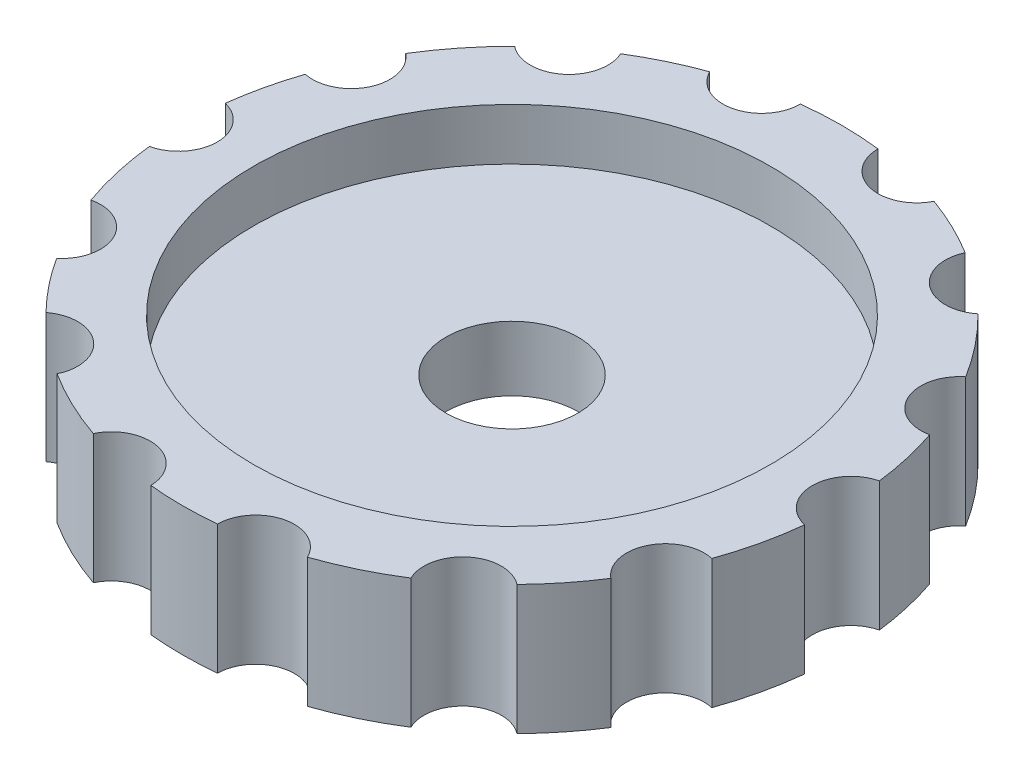
ISO-10303-21;
HEADER;
FILE_DESCRIPTION(('STEP AP214'),'2;1');
FILE_NAME('part.step','',(''),(''),'','','');
FILE_SCHEMA(('AUTOMOTIVE_DESIGN { 1 0 10303 214 1 1 1 1 }'));
ENDSEC;
DATA;
#1=APPLICATION_CONTEXT('core data for automotive mechanical design processes');
#2=APPLICATION_PROTOCOL_DEFINITION('international standard','automotive_design',2000,#1);
#3=PRODUCT_CONTEXT('',#1,'mechanical');
#4=PRODUCT('Part','Part','',(#3));
#5=PRODUCT_RELATED_PRODUCT_CATEGORY('part','',(#4));
#6=PRODUCT_DEFINITION_FORMATION('','',#4);
#7=PRODUCT_DEFINITION_CONTEXT('part definition',#1,'design');
#8=PRODUCT_DEFINITION('design','',#6,#7);
#9=PRODUCT_DEFINITION_SHAPE('','',#8);
#10=(LENGTH_UNIT() NAMED_UNIT(*) SI_UNIT(.MILLI.,.METRE.));
#11=(NAMED_UNIT(*) PLANE_ANGLE_UNIT() SI_UNIT($,.RADIAN.));
#12=(NAMED_UNIT(*) SI_UNIT($,.STERADIAN.) SOLID_ANGLE_UNIT());
#13=UNCERTAINTY_MEASURE_WITH_UNIT(LENGTH_MEASURE(1.E-05),#10,'distance_accuracy_value','');
#14=(GEOMETRIC_REPRESENTATION_CONTEXT(3) GLOBAL_UNCERTAINTY_ASSIGNED_CONTEXT((#13)) GLOBAL_UNIT_ASSIGNED_CONTEXT((#10,
#11,#12)) REPRESENTATION_CONTEXT('',''));
#15=CARTESIAN_POINT('',(0.,0.,0.));
#16=DIRECTION('',(0.,0.,1.));
#17=DIRECTION('',(1.,0.,0.));
#18=AXIS2_PLACEMENT_3D('',#15,#16,#17);
#19=CARTESIAN_POINT('',(0.,2.5,0.));
#20=DIRECTION('',(0.,-1.,0.));
#21=DIRECTION('',(0.,0.,-1.));
#22=AXIS2_PLACEMENT_3D('',#19,#20,#21);
#23=CYLINDRICAL_SURFACE('',#22,12.75);
#24=CARTESIAN_POINT('',(0.,-2.5,0.));
#25=DIRECTION('',(0.,1.,0.));
#26=DIRECTION('',(0.,0.,1.));
#27=AXIS2_PLACEMENT_3D('',#24,#25,#26);
#28=CIRCLE('',#27,12.75);
#29=CARTESIAN_POINT('',(12.653707331973,-2.5,-1.5640302927926));
#30=VERTEX_POINT('',#29);
#31=CARTESIAN_POINT('',(12.0792036811861,-2.5,-4.08109524863352));
#32=VERTEX_POINT('',#31);
#33=EDGE_CURVE('E214',#30,#32,#28,.T.);
#34=ORIENTED_EDGE('',*,*,#33,.T.);
#35=DIRECTION('',(0.,1.,0.));
#36=VECTOR('',#35,1.);
#37=CARTESIAN_POINT('',(12.0792036811861,0.,-4.08109524863353));
#38=LINE('',#37,#36);
#39=CARTESIAN_POINT('',(12.0792036811861,2.5,-4.08109524863352));
#40=VERTEX_POINT('',#39);
#41=EDGE_CURVE('E32',#32,#40,#38,.T.);
#42=ORIENTED_EDGE('',*,*,#41,.T.);
#43=CARTESIAN_POINT('',(0.,2.5,0.));
#44=DIRECTION('',(0.,1.,0.));
#45=DIRECTION('',(0.,0.,1.));
#46=AXIS2_PLACEMENT_3D('',#43,#44,#45);
#47=CIRCLE('',#46,12.75);
#48=CARTESIAN_POINT('',(12.653707331973,2.5,-1.5640302927926));
#49=VERTEX_POINT('',#48);
#50=EDGE_CURVE('E335',#49,#40,#47,.T.);
#51=ORIENTED_EDGE('',*,*,#50,.F.);
#52=DIRECTION('',(0.,1.,0.));
#53=VECTOR('',#52,1.);
#54=CARTESIAN_POINT('',(12.653707331973,0.,-1.5640302927926));
#55=LINE('',#54,#53);
#56=EDGE_CURVE('E293',#49,#30,#55,.F.);
#57=ORIENTED_EDGE('',*,*,#56,.T.);
#58=EDGE_LOOP('',(#34,#42,#51,#57));
#59=FACE_BOUND('',#58,.T.);
#60=ADVANCED_FACE('F17',(#59),#23,.T.);
#61=CARTESIAN_POINT('',(10.8343606042217,2.5,-6.72154225588801));
#62=VERTEX_POINT('',#61);
#63=CARTESIAN_POINT('',(8.9638911986455,2.5,-9.06703670329208));
#64=VERTEX_POINT('',#63);
#65=EDGE_CURVE('E208',#62,#64,#47,.T.);
#66=ORIENTED_EDGE('',*,*,#65,.F.);
#67=DIRECTION('',(0.,1.,0.));
#68=VECTOR('',#67,1.);
#69=CARTESIAN_POINT('',(10.8343606042217,0.,-6.72154225588801));
#70=LINE('',#69,#68);
#71=CARTESIAN_POINT('',(10.8343606042217,-2.5,-6.72154225588801));
#72=VERTEX_POINT('',#71);
#73=EDGE_CURVE('E201',#62,#72,#70,.F.);
#74=ORIENTED_EDGE('',*,*,#73,.T.);
#75=CARTESIAN_POINT('',(8.9638911986455,-2.5,-9.06703670329208));
#76=VERTEX_POINT('',#75);
#77=EDGE_CURVE('E39',#72,#76,#28,.T.);
#78=ORIENTED_EDGE('',*,*,#77,.T.);
#79=DIRECTION('',(0.,1.,0.));
#80=VECTOR('',#79,1.);
#81=CARTESIAN_POINT('',(8.9638911986455,0.,-9.06703670329208));
#82=LINE('',#81,#80);
#83=EDGE_CURVE('E508',#76,#64,#82,.T.);
#84=ORIENTED_EDGE('',*,*,#83,.T.);
#85=EDGE_LOOP('',(#66,#74,#78,#84));
#86=FACE_BOUND('',#85,.T.);
#87=ADVANCED_FACE('F207',(#86),#23,.T.);
#88=CARTESIAN_POINT('',(9.11226559962918,-2.5,8.91790982471872));
#89=VERTEX_POINT('',#88);
#90=CARTESIAN_POINT('',(10.7219890581264,-2.5,6.89938045315794));
#91=VERTEX_POINT('',#90);
#92=EDGE_CURVE('E263',#89,#91,#28,.T.);
#93=ORIENTED_EDGE('',*,*,#92,.T.);
#94=DIRECTION('',(0.,1.,0.));
#95=VECTOR('',#94,1.);
#96=CARTESIAN_POINT('',(10.7219890581264,0.,6.89938045315794));
#97=LINE('',#96,#95);
#98=CARTESIAN_POINT('',(10.7219890581264,2.5,6.89938045315794));
#99=VERTEX_POINT('',#98);
#100=EDGE_CURVE('E503',#91,#99,#97,.T.);
#101=ORIENTED_EDGE('',*,*,#100,.T.);
#102=CARTESIAN_POINT('',(9.11226559962918,2.5,8.91790982471872));
#103=VERTEX_POINT('',#102);
#104=EDGE_CURVE('E344',#103,#99,#47,.T.);
#105=ORIENTED_EDGE('',*,*,#104,.F.);
#106=DIRECTION('',(0.,1.,0.));
#107=VECTOR('',#106,1.);
#108=CARTESIAN_POINT('',(9.11226559962918,0.,8.91790982471872));
#109=LINE('',#108,#107);
#110=EDGE_CURVE('E491',#103,#89,#109,.F.);
#111=ORIENTED_EDGE('',*,*,#110,.T.);
#112=EDGE_LOOP('',(#93,#101,#105,#111));
#113=FACE_BOUND('',#112,.T.);
#114=ADVANCED_FACE('F439',(#113),#23,.T.);
#115=CARTESIAN_POINT('',(12.0102266927847,2.5,4.2798311634832));
#116=VERTEX_POINT('',#115);
#117=CARTESIAN_POINT('',(12.6777894946536,2.5,1.35504742693773));
#118=VERTEX_POINT('',#117);
#119=EDGE_CURVE('E339',#116,#118,#47,.T.);
#120=ORIENTED_EDGE('',*,*,#119,.F.);
#121=DIRECTION('',(0.,1.,0.));
#122=VECTOR('',#121,1.);
#123=CARTESIAN_POINT('',(12.0102266927847,0.,4.2798311634832));
#124=LINE('',#123,#122);
#125=CARTESIAN_POINT('',(12.0102266927847,-2.5,4.2798311634832));
#126=VERTEX_POINT('',#125);
#127=EDGE_CURVE('E282',#116,#126,#124,.F.);
#128=ORIENTED_EDGE('',*,*,#127,.T.);
#129=CARTESIAN_POINT('',(12.6777894946536,-2.5,1.35504742693773));
#130=VERTEX_POINT('',#129);
#131=EDGE_CURVE('E218',#126,#130,#28,.T.);
#132=ORIENTED_EDGE('',*,*,#131,.T.);
#133=DIRECTION('',(0.,1.,0.));
#134=VECTOR('',#133,1.);
#135=CARTESIAN_POINT('',(12.6777894946536,0.,1.35504742693773));
#136=LINE('',#135,#134);
#137=EDGE_CURVE('E281',#130,#118,#136,.T.);
#138=ORIENTED_EDGE('',*,*,#137,.T.);
#139=EDGE_LOOP('',(#120,#128,#132,#138));
#140=FACE_BOUND('',#139,.T.);
#141=ADVANCED_FACE('F280',(#140),#23,.T.);
#142=CARTESIAN_POINT('',(-1.29089798557912,-2.5,12.6844819520084));
#143=VERTEX_POINT('',#142);
#144=CARTESIAN_POINT('',(1.29089798557929,-2.5,12.6844819520084));
#145=VERTEX_POINT('',#144);
#146=EDGE_CURVE('E250',#143,#145,#28,.T.);
#147=ORIENTED_EDGE('',*,*,#146,.T.);
#148=DIRECTION('',(0.,1.,0.));
#149=VECTOR('',#148,1.);
#150=CARTESIAN_POINT('',(1.2908979855793,0.,12.6844819520084));
#151=LINE('',#150,#149);
#152=CARTESIAN_POINT('',(1.2908979855793,2.5,12.6844819520084));
#153=VERTEX_POINT('',#152);
#154=EDGE_CURVE('E496',#145,#153,#151,.T.);
#155=ORIENTED_EDGE('',*,*,#154,.T.);
#156=CARTESIAN_POINT('',(-1.29089798557912,2.5,12.6844819520084));
#157=VERTEX_POINT('',#156);
#158=EDGE_CURVE('E350',#157,#153,#47,.T.);
#159=ORIENTED_EDGE('',*,*,#158,.F.);
#160=DIRECTION('',(0.,1.,0.));
#161=VECTOR('',#160,1.);
#162=CARTESIAN_POINT('',(-1.29089798557912,0.,12.6844819520084));
#163=LINE('',#162,#161);
#164=EDGE_CURVE('E482',#157,#143,#163,.F.);
#165=ORIENTED_EDGE('',*,*,#164,.T.);
#166=EDGE_LOOP('',(#147,#155,#159,#165));
#167=FACE_BOUND('',#166,.T.);
#168=ADVANCED_FACE('F762',(#167),#23,.T.);
#169=CARTESIAN_POINT('',(4.14214711770383,2.5,12.0584044241059));
#170=VERTEX_POINT('',#169);
#171=CARTESIAN_POINT('',(6.84505372141108,2.5,10.7567532067532));
#172=VERTEX_POINT('',#171);
#173=EDGE_CURVE('E340',#170,#172,#47,.T.);
#174=ORIENTED_EDGE('',*,*,#173,.F.);
#175=DIRECTION('',(0.,1.,0.));
#176=VECTOR('',#175,1.);
#177=CARTESIAN_POINT('',(4.14214711770383,0.,12.0584044241059));
#178=LINE('',#177,#176);
#179=CARTESIAN_POINT('',(4.14214711770383,-2.5,12.0584044241059));
#180=VERTEX_POINT('',#179);
#181=EDGE_CURVE('E498',#170,#180,#178,.F.);
#182=ORIENTED_EDGE('',*,*,#181,.T.);
#183=CARTESIAN_POINT('',(6.84505372141108,-2.5,10.7567532067532));
#184=VERTEX_POINT('',#183);
#185=EDGE_CURVE('E219',#180,#184,#28,.T.);
#186=ORIENTED_EDGE('',*,*,#185,.T.);
#187=DIRECTION('',(0.,1.,0.));
#188=VECTOR('',#187,1.);
#189=CARTESIAN_POINT('',(6.84505372141108,0.,10.7567532067532));
#190=LINE('',#189,#188);
#191=EDGE_CURVE('E473',#184,#172,#190,.T.);
#192=ORIENTED_EDGE('',*,*,#191,.T.);
#193=EDGE_LOOP('',(#174,#182,#186,#192));
#194=FACE_BOUND('',#193,.T.);
#195=ADVANCED_FACE('F754',(#194),#23,.T.);
#196=CARTESIAN_POINT('',(-10.7219890581263,-2.5,6.89938045315808));
#197=VERTEX_POINT('',#196);
#198=CARTESIAN_POINT('',(-9.11226559962905,-2.5,8.91790982471885));
#199=VERTEX_POINT('',#198);
#200=EDGE_CURVE('E234',#197,#199,#28,.T.);
#201=ORIENTED_EDGE('',*,*,#200,.T.);
#202=DIRECTION('',(0.,1.,0.));
#203=VECTOR('',#202,1.);
#204=CARTESIAN_POINT('',(-9.11226559962905,0.,8.91790982471885));
#205=LINE('',#204,#203);
#206=CARTESIAN_POINT('',(-9.11226559962905,2.5,8.91790982471885));
#207=VERTEX_POINT('',#206);
#208=EDGE_CURVE('E469',#199,#207,#205,.T.);
#209=ORIENTED_EDGE('',*,*,#208,.T.);
#210=CARTESIAN_POINT('',(-10.7219890581263,2.5,6.89938045315808));
#211=VERTEX_POINT('',#210);
#212=EDGE_CURVE('E333',#211,#207,#47,.T.);
#213=ORIENTED_EDGE('',*,*,#212,.F.);
#214=DIRECTION('',(0.,1.,0.));
#215=VECTOR('',#214,1.);
#216=CARTESIAN_POINT('',(-10.7219890581263,0.,6.89938045315808));
#217=LINE('',#216,#215);
#218=EDGE_CURVE('E379',#211,#197,#217,.F.);
#219=ORIENTED_EDGE('',*,*,#218,.T.);
#220=EDGE_LOOP('',(#201,#209,#213,#219));
#221=FACE_BOUND('',#220,.T.);
#222=ADVANCED_FACE('F467',(#221),#23,.T.);
#223=CARTESIAN_POINT('',(-6.84505372141093,2.5,10.7567532067533));
#224=VERTEX_POINT('',#223);
#225=CARTESIAN_POINT('',(-4.14214711770367,2.5,12.058404424106));
#226=VERTEX_POINT('',#225);
#227=EDGE_CURVE('E347',#224,#226,#47,.T.);
#228=ORIENTED_EDGE('',*,*,#227,.F.);
#229=DIRECTION('',(0.,1.,0.));
#230=VECTOR('',#229,1.);
#231=CARTESIAN_POINT('',(-6.84505372141093,0.,10.7567532067533));
#232=LINE('',#231,#230);
#233=CARTESIAN_POINT('',(-6.84505372141093,-2.5,10.7567532067533));
#234=VERTEX_POINT('',#233);
#235=EDGE_CURVE('E472',#224,#234,#232,.F.);
#236=ORIENTED_EDGE('',*,*,#235,.T.);
#237=CARTESIAN_POINT('',(-4.14214711770367,-2.5,12.058404424106));
#238=VERTEX_POINT('',#237);
#239=EDGE_CURVE('E257',#234,#238,#28,.T.);
#240=ORIENTED_EDGE('',*,*,#239,.T.);
#241=DIRECTION('',(0.,1.,0.));
#242=VECTOR('',#241,1.);
#243=CARTESIAN_POINT('',(-4.14214711770367,0.,12.058404424106));
#244=LINE('',#243,#242);
#245=EDGE_CURVE('E480',#238,#226,#244,.T.);
#246=ORIENTED_EDGE('',*,*,#245,.T.);
#247=EDGE_LOOP('',(#228,#236,#240,#246));
#248=FACE_BOUND('',#247,.T.);
#249=ADVANCED_FACE('F478',(#248),#23,.T.);
#250=CARTESIAN_POINT('',(-12.0792036811862,-2.5,-4.08109524863336));
#251=VERTEX_POINT('',#250);
#252=CARTESIAN_POINT('',(-12.653707331973,-2.5,-1.56403029279243));
#253=VERTEX_POINT('',#252);
#254=EDGE_CURVE('E233',#251,#253,#28,.T.);
#255=ORIENTED_EDGE('',*,*,#254,.T.);
#256=DIRECTION('',(0.,1.,0.));
#257=VECTOR('',#256,1.);
#258=CARTESIAN_POINT('',(-12.653707331973,0.,-1.56403029279243));
#259=LINE('',#258,#257);
#260=CARTESIAN_POINT('',(-12.653707331973,2.5,-1.56403029279243));
#261=VERTEX_POINT('',#260);
#262=EDGE_CURVE('E374',#253,#261,#259,.T.);
#263=ORIENTED_EDGE('',*,*,#262,.T.);
#264=CARTESIAN_POINT('',(-12.0792036811862,2.5,-4.08109524863336));
#265=VERTEX_POINT('',#264);
#266=EDGE_CURVE('E232',#265,#261,#47,.T.);
#267=ORIENTED_EDGE('',*,*,#266,.F.);
#268=DIRECTION('',(0.,1.,0.));
#269=VECTOR('',#268,1.);
#270=CARTESIAN_POINT('',(-12.0792036811862,0.,-4.08109524863336));
#271=LINE('',#270,#269);
#272=EDGE_CURVE('E373',#265,#251,#271,.F.);
#273=ORIENTED_EDGE('',*,*,#272,.T.);
#274=EDGE_LOOP('',(#255,#263,#267,#273));
#275=FACE_BOUND('',#274,.T.);
#276=ADVANCED_FACE('F372',(#275),#23,.T.);
#277=CARTESIAN_POINT('',(-12.6777894946536,2.5,1.3550474269379));
#278=VERTEX_POINT('',#277);
#279=CARTESIAN_POINT('',(-12.0102266927846,2.5,4.27983116348336));
#280=VERTEX_POINT('',#279);
#281=EDGE_CURVE('E356',#278,#280,#47,.T.);
#282=ORIENTED_EDGE('',*,*,#281,.F.);
#283=DIRECTION('',(0.,1.,0.));
#284=VECTOR('',#283,1.);
#285=CARTESIAN_POINT('',(-12.6777894946536,0.,1.3550474269379));
#286=LINE('',#285,#284);
#287=CARTESIAN_POINT('',(-12.6777894946536,-2.5,1.3550474269379));
#288=VERTEX_POINT('',#287);
#289=EDGE_CURVE('E377',#278,#288,#286,.F.);
#290=ORIENTED_EDGE('',*,*,#289,.T.);
#291=CARTESIAN_POINT('',(-12.0102266927846,-2.5,4.27983116348336));
#292=VERTEX_POINT('',#291);
#293=EDGE_CURVE('E245',#288,#292,#28,.T.);
#294=ORIENTED_EDGE('',*,*,#293,.T.);
#295=DIRECTION('',(0.,1.,0.));
#296=VECTOR('',#295,1.);
#297=CARTESIAN_POINT('',(-12.0102266927846,0.,4.27983116348336));
#298=LINE('',#297,#296);
#299=EDGE_CURVE('E386',#292,#280,#298,.T.);
#300=ORIENTED_EDGE('',*,*,#299,.T.);
#301=EDGE_LOOP('',(#282,#290,#294,#300));
#302=FACE_BOUND('',#301,.T.);
#303=ADVANCED_FACE('F460',(#302),#23,.T.);
#304=CARTESIAN_POINT('',(-4.3405315614618,-2.5,-11.9884229890321));
#305=VERTEX_POINT('',#304);
#306=CARTESIAN_POINT('',(-6.66664935475142,-2.5,-10.8682236994273));
#307=VERTEX_POINT('',#306);
#308=EDGE_CURVE('E217',#305,#307,#28,.T.);
#309=ORIENTED_EDGE('',*,*,#308,.T.);
#310=DIRECTION('',(0.,1.,0.));
#311=VECTOR('',#310,1.);
#312=CARTESIAN_POINT('',(-6.66664935475143,0.,-10.8682236994273));
#313=LINE('',#312,#311);
#314=CARTESIAN_POINT('',(-6.66664935475143,2.5,-10.8682236994273));
#315=VERTEX_POINT('',#314);
#316=EDGE_CURVE('E393',#307,#315,#313,.T.);
#317=ORIENTED_EDGE('',*,*,#316,.T.);
#318=CARTESIAN_POINT('',(-4.3405315614618,2.5,-11.9884229890321));
#319=VERTEX_POINT('',#318);
#320=EDGE_CURVE('E231',#319,#315,#47,.T.);
#321=ORIENTED_EDGE('',*,*,#320,.F.);
#322=DIRECTION('',(0.,1.,0.));
#323=VECTOR('',#322,1.);
#324=CARTESIAN_POINT('',(-4.3405315614618,0.,-11.9884229890321));
#325=LINE('',#324,#323);
#326=EDGE_CURVE('E410',#319,#305,#325,.F.);
#327=ORIENTED_EDGE('',*,*,#326,.T.);
#328=EDGE_LOOP('',(#309,#317,#321,#327));
#329=FACE_BOUND('',#328,.T.);
#330=ADVANCED_FACE('F450',(#329),#23,.T.);
#331=CARTESIAN_POINT('',(-8.96389119864563,2.5,-9.06703670329195));
#332=VERTEX_POINT('',#331);
#333=CARTESIAN_POINT('',(-10.8343606042218,2.5,-6.72154225588786));
#334=VERTEX_POINT('',#333);
#335=EDGE_CURVE('E328',#332,#334,#47,.T.);
#336=ORIENTED_EDGE('',*,*,#335,.F.);
#337=DIRECTION('',(0.,1.,0.));
#338=VECTOR('',#337,1.);
#339=CARTESIAN_POINT('',(-8.96389119864563,0.,-9.06703670329195));
#340=LINE('',#339,#338);
#341=CARTESIAN_POINT('',(-8.96389119864563,-2.5,-9.06703670329195));
#342=VERTEX_POINT('',#341);
#343=EDGE_CURVE('E390',#332,#342,#340,.F.);
#344=ORIENTED_EDGE('',*,*,#343,.T.);
#345=CARTESIAN_POINT('',(-10.8343606042218,-2.5,-6.72154225588787));
#346=VERTEX_POINT('',#345);
#347=EDGE_CURVE('E225',#342,#346,#28,.T.);
#348=ORIENTED_EDGE('',*,*,#347,.T.);
#349=DIRECTION('',(0.,1.,0.));
#350=VECTOR('',#349,1.);
#351=CARTESIAN_POINT('',(-10.8343606042218,0.,-6.72154225588786));
#352=LINE('',#351,#350);
#353=EDGE_CURVE('E397',#346,#334,#352,.T.);
#354=ORIENTED_EDGE('',*,*,#353,.T.);
#355=EDGE_LOOP('',(#336,#344,#348,#354));
#356=FACE_BOUND('',#355,.T.);
#357=ADVANCED_FACE('F445',(#356),#23,.T.);
#358=CARTESIAN_POINT('',(6.66664935475127,2.5,-10.8682236994274));
#359=VERTEX_POINT('',#358);
#360=CARTESIAN_POINT('',(4.3405315614618,2.5,-11.9884229890321));
#361=VERTEX_POINT('',#360);
#362=EDGE_CURVE('E230',#359,#361,#47,.T.);
#363=ORIENTED_EDGE('',*,*,#362,.F.);
#364=DIRECTION('',(0.,1.,0.));
#365=VECTOR('',#364,1.);
#366=CARTESIAN_POINT('',(6.66664935475127,0.,-10.8682236994274));
#367=LINE('',#366,#365);
#368=CARTESIAN_POINT('',(6.66664935475127,-2.5,-10.8682236994274));
#369=VERTEX_POINT('',#368);
#370=EDGE_CURVE('E510',#359,#369,#367,.F.);
#371=ORIENTED_EDGE('',*,*,#370,.T.);
#372=CARTESIAN_POINT('',(4.3405315614618,-2.5,-11.9884229890321));
#373=VERTEX_POINT('',#372);
#374=EDGE_CURVE('E215',#369,#373,#28,.T.);
#375=ORIENTED_EDGE('',*,*,#374,.T.);
#376=DIRECTION('',(0.,1.,0.));
#377=VECTOR('',#376,1.);
#378=CARTESIAN_POINT('',(4.3405315614618,0.,-11.9884229890321));
#379=LINE('',#378,#377);
#380=EDGE_CURVE('E404',#373,#361,#379,.T.);
#381=ORIENTED_EDGE('',*,*,#380,.T.);
#382=EDGE_LOOP('',(#363,#371,#375,#381));
#383=FACE_BOUND('',#382,.T.);
#384=ADVANCED_FACE('F441',(#383),#23,.T.);
#385=CARTESIAN_POINT('',(1.5,2.5,-12.6614572621006));
#386=VERTEX_POINT('',#385);
#387=CARTESIAN_POINT('',(-1.5,2.5,-12.6614572621006));
#388=VERTEX_POINT('',#387);
#389=EDGE_CURVE('E224',#386,#388,#47,.T.);
#390=ORIENTED_EDGE('',*,*,#389,.F.);
#391=DIRECTION('',(0.,1.,0.));
#392=VECTOR('',#391,1.);
#393=CARTESIAN_POINT('',(1.5,0.,-12.6614572621006));
#394=LINE('',#393,#392);
#395=CARTESIAN_POINT('',(1.5,-2.5,-12.6614572621006));
#396=VERTEX_POINT('',#395);
#397=EDGE_CURVE('E402',#386,#396,#394,.F.);
#398=ORIENTED_EDGE('',*,*,#397,.T.);
#399=CARTESIAN_POINT('',(-1.5,-2.5,-12.6614572621006));
#400=VERTEX_POINT('',#399);
#401=EDGE_CURVE('E220',#396,#400,#28,.T.);
#402=ORIENTED_EDGE('',*,*,#401,.T.);
#403=DIRECTION('',(0.,1.,0.));
#404=VECTOR('',#403,1.);
#405=CARTESIAN_POINT('',(-1.5,0.,-12.6614572621006));
#406=LINE('',#405,#404);
#407=EDGE_CURVE('E412',#400,#388,#406,.T.);
#408=ORIENTED_EDGE('',*,*,#407,.T.);
#409=EDGE_LOOP('',(#390,#398,#402,#408));
#410=FACE_BOUND('',#409,.T.);
#411=ADVANCED_FACE('F19',(#410),#23,.T.);
#412=CARTESIAN_POINT('',(0.,2.5,0.));
#413=DIRECTION('',(0.,1.,0.));
#414=DIRECTION('',(0.,0.,1.));
#415=AXIS2_PLACEMENT_3D('',#412,#413,#414);
#416=PLANE('',#415);
#417=CARTESIAN_POINT('',(11.7695953070098,2.5,-5.54879503218598));
#418=DIRECTION('',(0.,1.,0.));
#419=DIRECTION('',(-0.781831482468022,0.,0.623489801858743));
#420=AXIS2_PLACEMENT_3D('',#417,#418,#419);
#421=CIRCLE('',#420,1.5);
#422=EDGE_CURVE('E209',#62,#40,#421,.T.);
#423=ORIENTED_EDGE('',*,*,#422,.F.);
#424=ORIENTED_EDGE('',*,*,#65,.T.);
#425=CARTESIAN_POINT('',(8.02865649585738,2.5,-10.2397839269941));
#426=DIRECTION('',(0.,1.,0.));
#427=DIRECTION('',(-0.781831482468022,0.,0.623489801858743));
#428=AXIS2_PLACEMENT_3D('',#425,#426,#427);
#429=CIRCLE('',#428,1.5);
#430=EDGE_CURVE('E513',#359,#64,#429,.T.);
#431=ORIENTED_EDGE('',*,*,#430,.F.);
#432=ORIENTED_EDGE('',*,*,#362,.T.);
#433=CARTESIAN_POINT('',(3.,2.5,-12.6614572621006));
#434=DIRECTION('',(0.,1.,0.));
#435=DIRECTION('',(0.,0.,1.));
#436=AXIS2_PLACEMENT_3D('',#433,#434,#435);
#437=CIRCLE('',#436,1.5);
#438=EDGE_CURVE('E400',#386,#361,#437,.T.);
#439=ORIENTED_EDGE('',*,*,#438,.F.);
#440=ORIENTED_EDGE('',*,*,#389,.T.);
#441=CARTESIAN_POINT('',(-3.,2.5,-12.6614572621006));
#442=DIRECTION('',(0.,1.,0.));
#443=DIRECTION('',(0.,0.,1.));
#444=AXIS2_PLACEMENT_3D('',#441,#442,#443);
#445=CIRCLE('',#444,1.5);
#446=EDGE_CURVE('E407',#319,#388,#445,.T.);
#447=ORIENTED_EDGE('',*,*,#446,.F.);
#448=ORIENTED_EDGE('',*,*,#320,.T.);
#449=CARTESIAN_POINT('',(-8.02865649585753,2.5,-10.239783926994));
#450=DIRECTION('',(0.,1.,0.));
#451=DIRECTION('',(0.781831482468031,0.,0.623489801858732));
#452=AXIS2_PLACEMENT_3D('',#449,#450,#451);
#453=CIRCLE('',#452,1.5);
#454=EDGE_CURVE('E388',#332,#315,#453,.T.);
#455=ORIENTED_EDGE('',*,*,#454,.F.);
#456=ORIENTED_EDGE('',*,*,#335,.T.);
#457=CARTESIAN_POINT('',(-11.7695953070099,2.5,-5.54879503218581));
#458=DIRECTION('',(0.,1.,0.));
#459=DIRECTION('',(0.781831482468031,0.,0.623489801858732));
#460=AXIS2_PLACEMENT_3D('',#457,#458,#459);
#461=CIRCLE('',#460,1.5);
#462=EDGE_CURVE('E371',#265,#334,#461,.T.);
#463=ORIENTED_EDGE('',*,*,#462,.F.);
#464=ORIENTED_EDGE('',*,*,#266,.T.);
#465=CARTESIAN_POINT('',(-13.0115708955881,2.5,-0.107344441334835));
#466=DIRECTION('',(0.,1.,0.));
#467=DIRECTION('',(0.974927912181823,0.,-0.222520933956318));
#468=AXIS2_PLACEMENT_3D('',#465,#466,#467);
#469=CIRCLE('',#468,1.5);
#470=EDGE_CURVE('E369',#278,#261,#469,.T.);
#471=ORIENTED_EDGE('',*,*,#470,.F.);
#472=ORIENTED_EDGE('',*,*,#281,.T.);
#473=CARTESIAN_POINT('',(-11.6764452918502,2.5,5.7422230317561));
#474=DIRECTION('',(0.,1.,0.));
#475=DIRECTION('',(0.974927912181823,0.,-0.222520933956318));
#476=AXIS2_PLACEMENT_3D('',#473,#474,#475);
#477=CIRCLE('',#476,1.5);
#478=EDGE_CURVE('E376',#211,#280,#477,.T.);
#479=ORIENTED_EDGE('',*,*,#478,.F.);
#480=ORIENTED_EDGE('',*,*,#212,.T.);
#481=CARTESIAN_POINT('',(-8.19650702326456,2.5,10.105927598077));
#482=DIRECTION('',(0.,1.,0.));
#483=DIRECTION('',(0.433883739117553,0.,-0.900968867902422));
#484=AXIS2_PLACEMENT_3D('',#481,#482,#483);
#485=CIRCLE('',#484,1.5);
#486=EDGE_CURVE('E470',#224,#207,#485,.T.);
#487=ORIENTED_EDGE('',*,*,#486,.F.);
#488=ORIENTED_EDGE('',*,*,#227,.T.);
#489=CARTESIAN_POINT('',(-2.79069381585003,2.5,12.7092300327823));
#490=DIRECTION('',(0.,1.,0.));
#491=DIRECTION('',(0.433883739117553,0.,-0.900968867902422));
#492=AXIS2_PLACEMENT_3D('',#489,#490,#491);
#493=CIRCLE('',#492,1.5);
#494=EDGE_CURVE('E484',#157,#226,#493,.T.);
#495=ORIENTED_EDGE('',*,*,#494,.F.);
#496=ORIENTED_EDGE('',*,*,#158,.T.);
#497=CARTESIAN_POINT('',(2.79069381585021,2.5,12.7092300327823));
#498=DIRECTION('',(0.,1.,0.));
#499=DIRECTION('',(-0.433883739117565,0.,-0.900968867902416));
#500=AXIS2_PLACEMENT_3D('',#497,#498,#499);
#501=CIRCLE('',#500,1.5);
#502=EDGE_CURVE('E292',#170,#153,#501,.T.);
#503=ORIENTED_EDGE('',*,*,#502,.F.);
#504=ORIENTED_EDGE('',*,*,#173,.T.);
#505=CARTESIAN_POINT('',(8.1965070232647,2.5,10.1059275980769));
#506=DIRECTION('',(0.,1.,0.));
#507=DIRECTION('',(-0.433883739117565,0.,-0.900968867902416));
#508=AXIS2_PLACEMENT_3D('',#505,#506,#507);
#509=CIRCLE('',#508,1.5);
#510=EDGE_CURVE('E493',#103,#172,#509,.T.);
#511=ORIENTED_EDGE('',*,*,#510,.F.);
#512=ORIENTED_EDGE('',*,*,#104,.T.);
#513=CARTESIAN_POINT('',(11.6764452918502,2.5,5.74222303175594));
#514=DIRECTION('',(0.,1.,0.));
#515=DIRECTION('',(-0.974927912181826,0.,-0.222520933956305));
#516=AXIS2_PLACEMENT_3D('',#513,#514,#515);
#517=CIRCLE('',#516,1.5);
#518=EDGE_CURVE('E506',#116,#99,#517,.T.);
#519=ORIENTED_EDGE('',*,*,#518,.F.);
#520=ORIENTED_EDGE('',*,*,#119,.T.);
#521=CARTESIAN_POINT('',(13.0115708955881,2.5,-0.107344441335012));
#522=DIRECTION('',(0.,1.,0.));
#523=DIRECTION('',(-0.974927912181826,0.,-0.222520933956305));
#524=AXIS2_PLACEMENT_3D('',#521,#522,#523);
#525=CIRCLE('',#524,1.5);
#526=EDGE_CURVE('E291',#49,#118,#525,.T.);
#527=ORIENTED_EDGE('',*,*,#526,.F.);
#528=ORIENTED_EDGE('',*,*,#50,.T.);
#529=EDGE_LOOP('',(#423,#424,#431,#432,#439,#440,#447,#448,#455,#456,#463,#464,#471,#472,#479,
#480,#487,#488,#495,#496,#503,#504,#511,#512,#519,#520,#527,#528));
#530=FACE_BOUND('',#529,.T.);
#531=CARTESIAN_POINT('',(0.,2.5,0.));
#532=DIRECTION('',(0.,1.,0.));
#533=DIRECTION('',(0.,0.,1.));
#534=AXIS2_PLACEMENT_3D('',#531,#532,#533);
#535=CIRCLE('',#534,10.);
#536=CARTESIAN_POINT('',(0.,2.5,10.));
#537=VERTEX_POINT('',#536);
#538=EDGE_CURVE('E414',#537,#537,#535,.T.);
#539=ORIENTED_EDGE('',*,*,#538,.F.);
#540=EDGE_LOOP('',(#539));
#541=FACE_BOUND('',#540,.T.);
#542=ADVANCED_FACE('F367',(#530,#541),#416,.T.);
#543=CARTESIAN_POINT('',(0.,-2.5,0.));
#544=DIRECTION('',(0.,1.,0.));
#545=DIRECTION('',(0.,0.,1.));
#546=AXIS2_PLACEMENT_3D('',#543,#544,#545);
#547=PLANE('',#546);
#548=CARTESIAN_POINT('',(0.,-2.5,0.));
#549=DIRECTION('',(0.,-1.,0.));
#550=DIRECTION('',(0.,0.,-1.));
#551=AXIS2_PLACEMENT_3D('',#548,#549,#550);
#552=CIRCLE('',#551,10.);
#553=CARTESIAN_POINT('',(0.,-2.5,-10.));
#554=VERTEX_POINT('',#553);
#555=EDGE_CURVE('E242',#554,#554,#552,.T.);
#556=ORIENTED_EDGE('',*,*,#555,.F.);
#557=EDGE_LOOP('',(#556));
#558=FACE_BOUND('',#557,.T.);
#559=ORIENTED_EDGE('',*,*,#77,.F.);
#560=CARTESIAN_POINT('',(11.7695953070098,-2.5,-5.54879503218598));
#561=DIRECTION('',(0.,1.,0.));
#562=DIRECTION('',(0.,0.,1.));
#563=AXIS2_PLACEMENT_3D('',#560,#561,#562);
#564=CIRCLE('',#563,1.5);
#565=EDGE_CURVE('E11',#72,#32,#564,.T.);
#566=ORIENTED_EDGE('',*,*,#565,.T.);
#567=ORIENTED_EDGE('',*,*,#33,.F.);
#568=CARTESIAN_POINT('',(13.0115708955881,-2.5,-0.107344441335012));
#569=DIRECTION('',(0.,1.,0.));
#570=DIRECTION('',(0.,0.,1.));
#571=AXIS2_PLACEMENT_3D('',#568,#569,#570);
#572=CIRCLE('',#571,1.5);
#573=EDGE_CURVE('E288',#30,#130,#572,.T.);
#574=ORIENTED_EDGE('',*,*,#573,.T.);
#575=ORIENTED_EDGE('',*,*,#131,.F.);
#576=CARTESIAN_POINT('',(11.6764452918502,-2.5,5.74222303175594));
#577=DIRECTION('',(0.,1.,0.));
#578=DIRECTION('',(0.,0.,1.));
#579=AXIS2_PLACEMENT_3D('',#576,#577,#578);
#580=CIRCLE('',#579,1.5);
#581=EDGE_CURVE('E295',#126,#91,#580,.T.);
#582=ORIENTED_EDGE('',*,*,#581,.T.);
#583=ORIENTED_EDGE('',*,*,#92,.F.);
#584=CARTESIAN_POINT('',(8.1965070232647,-2.5,10.1059275980769));
#585=DIRECTION('',(0.,1.,0.));
#586=DIRECTION('',(0.,0.,1.));
#587=AXIS2_PLACEMENT_3D('',#584,#585,#586);
#588=CIRCLE('',#587,1.5);
#589=EDGE_CURVE('E300',#89,#184,#588,.T.);
#590=ORIENTED_EDGE('',*,*,#589,.T.);
#591=ORIENTED_EDGE('',*,*,#185,.F.);
#592=CARTESIAN_POINT('',(2.79069381585021,-2.5,12.7092300327823));
#593=DIRECTION('',(0.,1.,0.));
#594=DIRECTION('',(0.,0.,1.));
#595=AXIS2_PLACEMENT_3D('',#592,#593,#594);
#596=CIRCLE('',#595,1.5);
#597=EDGE_CURVE('E296',#180,#145,#596,.T.);
#598=ORIENTED_EDGE('',*,*,#597,.T.);
#599=ORIENTED_EDGE('',*,*,#146,.F.);
#600=CARTESIAN_POINT('',(-2.79069381585003,-2.5,12.7092300327823));
#601=DIRECTION('',(0.,1.,0.));
#602=DIRECTION('',(0.,0.,1.));
#603=AXIS2_PLACEMENT_3D('',#600,#601,#602);
#604=CIRCLE('',#603,1.5);
#605=EDGE_CURVE('E308',#143,#238,#604,.T.);
#606=ORIENTED_EDGE('',*,*,#605,.T.);
#607=ORIENTED_EDGE('',*,*,#239,.F.);
#608=CARTESIAN_POINT('',(-8.19650702326456,-2.5,10.105927598077));
#609=DIRECTION('',(0.,1.,0.));
#610=DIRECTION('',(0.,0.,1.));
#611=AXIS2_PLACEMENT_3D('',#608,#609,#610);
#612=CIRCLE('',#611,1.5);
#613=EDGE_CURVE('E305',#234,#199,#612,.T.);
#614=ORIENTED_EDGE('',*,*,#613,.T.);
#615=ORIENTED_EDGE('',*,*,#200,.F.);
#616=CARTESIAN_POINT('',(-11.6764452918502,-2.5,5.7422230317561));
#617=DIRECTION('',(0.,1.,0.));
#618=DIRECTION('',(0.,0.,1.));
#619=AXIS2_PLACEMENT_3D('',#616,#617,#618);
#620=CIRCLE('',#619,1.5);
#621=EDGE_CURVE('E314',#197,#292,#620,.T.);
#622=ORIENTED_EDGE('',*,*,#621,.T.);
#623=ORIENTED_EDGE('',*,*,#293,.F.);
#624=CARTESIAN_POINT('',(-13.0115708955881,-2.5,-0.107344441334835));
#625=DIRECTION('',(0.,1.,0.));
#626=DIRECTION('',(0.,0.,1.));
#627=AXIS2_PLACEMENT_3D('',#624,#625,#626);
#628=CIRCLE('',#627,1.5);
#629=EDGE_CURVE('E311',#288,#253,#628,.T.);
#630=ORIENTED_EDGE('',*,*,#629,.T.);
#631=ORIENTED_EDGE('',*,*,#254,.F.);
#632=CARTESIAN_POINT('',(-11.7695953070099,-2.5,-5.54879503218581));
#633=DIRECTION('',(0.,1.,0.));
#634=DIRECTION('',(0.,0.,1.));
#635=AXIS2_PLACEMENT_3D('',#632,#633,#634);
#636=CIRCLE('',#635,1.5);
#637=EDGE_CURVE('E320',#251,#346,#636,.T.);
#638=ORIENTED_EDGE('',*,*,#637,.T.);
#639=ORIENTED_EDGE('',*,*,#347,.F.);
#640=CARTESIAN_POINT('',(-8.02865649585753,-2.5,-10.239783926994));
#641=DIRECTION('',(0.,1.,0.));
#642=DIRECTION('',(0.,0.,1.));
#643=AXIS2_PLACEMENT_3D('',#640,#641,#642);
#644=CIRCLE('',#643,1.5);
#645=EDGE_CURVE('E317',#342,#307,#644,.T.);
#646=ORIENTED_EDGE('',*,*,#645,.T.);
#647=ORIENTED_EDGE('',*,*,#308,.F.);
#648=CARTESIAN_POINT('',(-3.,-2.5,-12.6614572621006));
#649=DIRECTION('',(0.,1.,0.));
#650=DIRECTION('',(0.,0.,1.));
#651=AXIS2_PLACEMENT_3D('',#648,#649,#650);
#652=CIRCLE('',#651,1.5);
#653=EDGE_CURVE('E325',#305,#400,#652,.T.);
#654=ORIENTED_EDGE('',*,*,#653,.T.);
#655=ORIENTED_EDGE('',*,*,#401,.F.);
#656=CARTESIAN_POINT('',(3.,-2.5,-12.6614572621006));
#657=DIRECTION('',(0.,1.,0.));
#658=DIRECTION('',(0.,0.,1.));
#659=AXIS2_PLACEMENT_3D('',#656,#657,#658);
#660=CIRCLE('',#659,1.5);
#661=EDGE_CURVE('E323',#396,#373,#660,.T.);
#662=ORIENTED_EDGE('',*,*,#661,.T.);
#663=ORIENTED_EDGE('',*,*,#374,.F.);
#664=CARTESIAN_POINT('',(8.02865649585738,-2.5,-10.2397839269941));
#665=DIRECTION('',(0.,1.,0.));
#666=DIRECTION('',(0.,0.,1.));
#667=AXIS2_PLACEMENT_3D('',#664,#665,#666);
#668=CIRCLE('',#667,1.5);
#669=EDGE_CURVE('E25',#369,#76,#668,.T.);
#670=ORIENTED_EDGE('',*,*,#669,.T.);
#671=EDGE_LOOP('',(#559,#566,#567,#574,#575,#582,#583,#590,#591,#598,#599,#606,#607,#614,#615,
#622,#623,#630,#631,#638,#639,#646,#647,#654,#655,#662,#663,#670));
#672=FACE_BOUND('',#671,.T.);
#673=ADVANCED_FACE('F212',(#558,#672),#547,.F.);
#674=CARTESIAN_POINT('',(0.,-2.,0.));
#675=DIRECTION('',(0.,-1.,0.));
#676=DIRECTION('',(0.,0.,-1.));
#677=AXIS2_PLACEMENT_3D('',#674,#675,#676);
#678=CYLINDRICAL_SURFACE('',#677,10.);
#679=CARTESIAN_POINT('',(0.,-2.,0.));
#680=DIRECTION('',(0.,-1.,0.));
#681=DIRECTION('',(0.,0.,-1.));
#682=AXIS2_PLACEMENT_3D('',#679,#680,#681);
#683=CIRCLE('',#682,10.);
#684=CARTESIAN_POINT('',(0.,-2.,-10.));
#685=VERTEX_POINT('',#684);
#686=EDGE_CURVE('E235',#685,#685,#683,.T.);
#687=ORIENTED_EDGE('',*,*,#686,.F.);
#688=EDGE_LOOP('',(#687));
#689=FACE_BOUND('',#688,.T.);
#690=ORIENTED_EDGE('',*,*,#555,.T.);
#691=EDGE_LOOP('',(#690));
#692=FACE_BOUND('',#691,.T.);
#693=ADVANCED_FACE('F422',(#689,#692),#678,.F.);
#694=CARTESIAN_POINT('',(0.,-2.,0.));
#695=DIRECTION('',(0.,-1.,0.));
#696=DIRECTION('',(0.,0.,-1.));
#697=AXIS2_PLACEMENT_3D('',#694,#695,#696);
#698=PLANE('',#697);
#699=CARTESIAN_POINT('',(0.,-2.,0.));
#700=DIRECTION('',(0.,-1.,0.));
#701=DIRECTION('',(0.,0.,-1.));
#702=AXIS2_PLACEMENT_3D('',#699,#700,#701);
#703=CIRCLE('',#702,2.5527);
#704=CARTESIAN_POINT('',(0.,-2.,-2.5527));
#705=VERTEX_POINT('',#704);
#706=EDGE_CURVE('E517',#705,#705,#703,.T.);
#707=ORIENTED_EDGE('',*,*,#706,.F.);
#708=EDGE_LOOP('',(#707));
#709=FACE_BOUND('',#708,.T.);
#710=ORIENTED_EDGE('',*,*,#686,.T.);
#711=EDGE_LOOP('',(#710));
#712=FACE_BOUND('',#711,.T.);
#713=ADVANCED_FACE('F430',(#709,#712),#698,.T.);
#714=CARTESIAN_POINT('',(0.,0.5,0.));
#715=DIRECTION('',(0.,1.,0.));
#716=DIRECTION('',(0.,0.,1.));
#717=AXIS2_PLACEMENT_3D('',#714,#715,#716);
#718=CYLINDRICAL_SURFACE('',#717,10.);
#719=CARTESIAN_POINT('',(0.,0.5,0.));
#720=DIRECTION('',(0.,1.,0.));
#721=DIRECTION('',(0.,0.,1.));
#722=AXIS2_PLACEMENT_3D('',#719,#720,#721);
#723=CIRCLE('',#722,10.);
#724=CARTESIAN_POINT('',(0.,0.5,10.));
#725=VERTEX_POINT('',#724);
#726=EDGE_CURVE('E415',#725,#725,#723,.T.);
#727=ORIENTED_EDGE('',*,*,#726,.F.);
#728=EDGE_LOOP('',(#727));
#729=FACE_BOUND('',#728,.T.);
#730=ORIENTED_EDGE('',*,*,#538,.T.);
#731=EDGE_LOOP('',(#730));
#732=FACE_BOUND('',#731,.T.);
#733=ADVANCED_FACE('F529',(#729,#732),#718,.F.);
#734=CARTESIAN_POINT('',(0.,0.5,0.));
#735=DIRECTION('',(0.,1.,0.));
#736=DIRECTION('',(0.,0.,1.));
#737=AXIS2_PLACEMENT_3D('',#734,#735,#736);
#738=PLANE('',#737);
#739=CARTESIAN_POINT('',(0.,0.5,0.));
#740=DIRECTION('',(0.,1.,0.));
#741=DIRECTION('',(0.,0.,1.));
#742=AXIS2_PLACEMENT_3D('',#739,#740,#741);
#743=CIRCLE('',#742,2.5527);
#744=CARTESIAN_POINT('',(0.,0.5,2.5527));
#745=VERTEX_POINT('',#744);
#746=EDGE_CURVE('E520',#745,#745,#743,.T.);
#747=ORIENTED_EDGE('',*,*,#746,.F.);
#748=EDGE_LOOP('',(#747));
#749=FACE_BOUND('',#748,.T.);
#750=ORIENTED_EDGE('',*,*,#726,.T.);
#751=EDGE_LOOP('',(#750));
#752=FACE_BOUND('',#751,.T.);
#753=ADVANCED_FACE('F526',(#749,#752),#738,.T.);
#754=CARTESIAN_POINT('',(-3.,-2.5,-12.6614572621006));
#755=DIRECTION('',(0.,1.,0.));
#756=DIRECTION('',(0.,0.,1.));
#757=AXIS2_PLACEMENT_3D('',#754,#755,#756);
#758=CYLINDRICAL_SURFACE('',#757,1.5);
#759=ORIENTED_EDGE('',*,*,#653,.F.);
#760=ORIENTED_EDGE('',*,*,#326,.F.);
#761=ORIENTED_EDGE('',*,*,#446,.T.);
#762=ORIENTED_EDGE('',*,*,#407,.F.);
#763=EDGE_LOOP('',(#759,#760,#761,#762));
#764=FACE_BOUND('',#763,.T.);
#765=ADVANCED_FACE('F449',(#764),#758,.F.);
#766=CARTESIAN_POINT('',(3.,-2.5,-12.6614572621006));
#767=DIRECTION('',(0.,1.,0.));
#768=DIRECTION('',(0.,0.,1.));
#769=AXIS2_PLACEMENT_3D('',#766,#767,#768);
#770=CYLINDRICAL_SURFACE('',#769,1.5);
#771=ORIENTED_EDGE('',*,*,#661,.F.);
#772=ORIENTED_EDGE('',*,*,#397,.F.);
#773=ORIENTED_EDGE('',*,*,#438,.T.);
#774=ORIENTED_EDGE('',*,*,#380,.F.);
#775=EDGE_LOOP('',(#771,#772,#773,#774));
#776=FACE_BOUND('',#775,.T.);
#777=ADVANCED_FACE('F545',(#776),#770,.F.);
#778=CARTESIAN_POINT('',(-11.7695953070099,-2.5,-5.54879503218581));
#779=DIRECTION('',(0.,1.,0.));
#780=DIRECTION('',(0.,0.,1.));
#781=AXIS2_PLACEMENT_3D('',#778,#779,#780);
#782=CYLINDRICAL_SURFACE('',#781,1.5);
#783=ORIENTED_EDGE('',*,*,#637,.F.);
#784=ORIENTED_EDGE('',*,*,#272,.F.);
#785=ORIENTED_EDGE('',*,*,#462,.T.);
#786=ORIENTED_EDGE('',*,*,#353,.F.);
#787=EDGE_LOOP('',(#783,#784,#785,#786));
#788=FACE_BOUND('',#787,.T.);
#789=ADVANCED_FACE('F458',(#788),#782,.F.);
#790=CARTESIAN_POINT('',(-8.02865649585753,-2.5,-10.239783926994));
#791=DIRECTION('',(0.,1.,0.));
#792=DIRECTION('',(0.,0.,1.));
#793=AXIS2_PLACEMENT_3D('',#790,#791,#792);
#794=CYLINDRICAL_SURFACE('',#793,1.5);
#795=ORIENTED_EDGE('',*,*,#645,.F.);
#796=ORIENTED_EDGE('',*,*,#343,.F.);
#797=ORIENTED_EDGE('',*,*,#454,.T.);
#798=ORIENTED_EDGE('',*,*,#316,.F.);
#799=EDGE_LOOP('',(#795,#796,#797,#798));
#800=FACE_BOUND('',#799,.T.);
#801=ADVANCED_FACE('F453',(#800),#794,.F.);
#802=CARTESIAN_POINT('',(-11.6764452918502,-2.5,5.7422230317561));
#803=DIRECTION('',(0.,1.,0.));
#804=DIRECTION('',(0.,0.,1.));
#805=AXIS2_PLACEMENT_3D('',#802,#803,#804);
#806=CYLINDRICAL_SURFACE('',#805,1.5);
#807=ORIENTED_EDGE('',*,*,#621,.F.);
#808=ORIENTED_EDGE('',*,*,#218,.F.);
#809=ORIENTED_EDGE('',*,*,#478,.T.);
#810=ORIENTED_EDGE('',*,*,#299,.F.);
#811=EDGE_LOOP('',(#807,#808,#809,#810));
#812=FACE_BOUND('',#811,.T.);
#813=ADVANCED_FACE('F462',(#812),#806,.F.);
#814=CARTESIAN_POINT('',(-13.0115708955881,-2.5,-0.107344441334835));
#815=DIRECTION('',(0.,1.,0.));
#816=DIRECTION('',(0.,0.,1.));
#817=AXIS2_PLACEMENT_3D('',#814,#815,#816);
#818=CYLINDRICAL_SURFACE('',#817,1.5);
#819=ORIENTED_EDGE('',*,*,#629,.F.);
#820=ORIENTED_EDGE('',*,*,#289,.F.);
#821=ORIENTED_EDGE('',*,*,#470,.T.);
#822=ORIENTED_EDGE('',*,*,#262,.F.);
#823=EDGE_LOOP('',(#819,#820,#821,#822));
#824=FACE_BOUND('',#823,.T.);
#825=ADVANCED_FACE('F459',(#824),#818,.F.);
#826=CARTESIAN_POINT('',(-2.79069381585003,-2.5,12.7092300327823));
#827=DIRECTION('',(0.,1.,0.));
#828=DIRECTION('',(0.,0.,1.));
#829=AXIS2_PLACEMENT_3D('',#826,#827,#828);
#830=CYLINDRICAL_SURFACE('',#829,1.5);
#831=ORIENTED_EDGE('',*,*,#605,.F.);
#832=ORIENTED_EDGE('',*,*,#164,.F.);
#833=ORIENTED_EDGE('',*,*,#494,.T.);
#834=ORIENTED_EDGE('',*,*,#245,.F.);
#835=EDGE_LOOP('',(#831,#832,#833,#834));
#836=FACE_BOUND('',#835,.T.);
#837=ADVANCED_FACE('F557',(#836),#830,.F.);
#838=CARTESIAN_POINT('',(-8.19650702326456,-2.5,10.105927598077));
#839=DIRECTION('',(0.,1.,0.));
#840=DIRECTION('',(0.,0.,1.));
#841=AXIS2_PLACEMENT_3D('',#838,#839,#840);
#842=CYLINDRICAL_SURFACE('',#841,1.5);
#843=ORIENTED_EDGE('',*,*,#613,.F.);
#844=ORIENTED_EDGE('',*,*,#235,.F.);
#845=ORIENTED_EDGE('',*,*,#486,.T.);
#846=ORIENTED_EDGE('',*,*,#208,.F.);
#847=EDGE_LOOP('',(#843,#844,#845,#846));
#848=FACE_BOUND('',#847,.T.);
#849=ADVANCED_FACE('F560',(#848),#842,.F.);
#850=CARTESIAN_POINT('',(8.1965070232647,-2.5,10.1059275980769));
#851=DIRECTION('',(0.,1.,0.));
#852=DIRECTION('',(0.,0.,1.));
#853=AXIS2_PLACEMENT_3D('',#850,#851,#852);
#854=CYLINDRICAL_SURFACE('',#853,1.5);
#855=ORIENTED_EDGE('',*,*,#589,.F.);
#856=ORIENTED_EDGE('',*,*,#110,.F.);
#857=ORIENTED_EDGE('',*,*,#510,.T.);
#858=ORIENTED_EDGE('',*,*,#191,.F.);
#859=EDGE_LOOP('',(#855,#856,#857,#858));
#860=FACE_BOUND('',#859,.T.);
#861=ADVANCED_FACE('F563',(#860),#854,.F.);
#862=CARTESIAN_POINT('',(2.79069381585021,-2.5,12.7092300327823));
#863=DIRECTION('',(0.,1.,0.));
#864=DIRECTION('',(0.,0.,1.));
#865=AXIS2_PLACEMENT_3D('',#862,#863,#864);
#866=CYLINDRICAL_SURFACE('',#865,1.5);
#867=ORIENTED_EDGE('',*,*,#597,.F.);
#868=ORIENTED_EDGE('',*,*,#181,.F.);
#869=ORIENTED_EDGE('',*,*,#502,.T.);
#870=ORIENTED_EDGE('',*,*,#154,.F.);
#871=EDGE_LOOP('',(#867,#868,#869,#870));
#872=FACE_BOUND('',#871,.T.);
#873=ADVANCED_FACE('F566',(#872),#866,.F.);
#874=CARTESIAN_POINT('',(13.0115708955881,-2.5,-0.107344441335012));
#875=DIRECTION('',(0.,1.,0.));
#876=DIRECTION('',(0.,0.,1.));
#877=AXIS2_PLACEMENT_3D('',#874,#875,#876);
#878=CYLINDRICAL_SURFACE('',#877,1.5);
#879=ORIENTED_EDGE('',*,*,#573,.F.);
#880=ORIENTED_EDGE('',*,*,#56,.F.);
#881=ORIENTED_EDGE('',*,*,#526,.T.);
#882=ORIENTED_EDGE('',*,*,#137,.F.);
#883=EDGE_LOOP('',(#879,#880,#881,#882));
#884=FACE_BOUND('',#883,.T.);
#885=ADVANCED_FACE('F287',(#884),#878,.F.);
#886=CARTESIAN_POINT('',(11.6764452918502,-2.5,5.74222303175594));
#887=DIRECTION('',(0.,1.,0.));
#888=DIRECTION('',(0.,0.,1.));
#889=AXIS2_PLACEMENT_3D('',#886,#887,#888);
#890=CYLINDRICAL_SURFACE('',#889,1.5);
#891=ORIENTED_EDGE('',*,*,#581,.F.);
#892=ORIENTED_EDGE('',*,*,#127,.F.);
#893=ORIENTED_EDGE('',*,*,#518,.T.);
#894=ORIENTED_EDGE('',*,*,#100,.F.);
#895=EDGE_LOOP('',(#891,#892,#893,#894));
#896=FACE_BOUND('',#895,.T.);
#897=ADVANCED_FACE('F573',(#896),#890,.F.);
#898=CARTESIAN_POINT('',(8.02865649585738,-2.5,-10.2397839269941));
#899=DIRECTION('',(0.,1.,0.));
#900=DIRECTION('',(0.,0.,1.));
#901=AXIS2_PLACEMENT_3D('',#898,#899,#900);
#902=CYLINDRICAL_SURFACE('',#901,1.5);
#903=ORIENTED_EDGE('',*,*,#669,.F.);
#904=ORIENTED_EDGE('',*,*,#370,.F.);
#905=ORIENTED_EDGE('',*,*,#430,.T.);
#906=ORIENTED_EDGE('',*,*,#83,.F.);
#907=EDGE_LOOP('',(#903,#904,#905,#906));
#908=FACE_BOUND('',#907,.T.);
#909=ADVANCED_FACE('F576',(#908),#902,.F.);
#910=CARTESIAN_POINT('',(11.7695953070098,-2.5,-5.54879503218598));
#911=DIRECTION('',(0.,1.,0.));
#912=DIRECTION('',(0.,0.,1.));
#913=AXIS2_PLACEMENT_3D('',#910,#911,#912);
#914=CYLINDRICAL_SURFACE('',#913,1.5);
#915=ORIENTED_EDGE('',*,*,#565,.F.);
#916=ORIENTED_EDGE('',*,*,#73,.F.);
#917=ORIENTED_EDGE('',*,*,#422,.T.);
#918=ORIENTED_EDGE('',*,*,#41,.F.);
#919=EDGE_LOOP('',(#915,#916,#917,#918));
#920=FACE_BOUND('',#919,.T.);
#921=ADVANCED_FACE('F200',(#920),#914,.F.);
#922=CARTESIAN_POINT('',(0.,0.5,0.));
#923=DIRECTION('',(0.,1.,0.));
#924=DIRECTION('',(0.,0.,1.));
#925=AXIS2_PLACEMENT_3D('',#922,#923,#924);
#926=CYLINDRICAL_SURFACE('',#925,2.5527);
#927=ORIENTED_EDGE('',*,*,#706,.T.);
#928=EDGE_LOOP('',(#927));
#929=FACE_BOUND('',#928,.T.);
#930=ORIENTED_EDGE('',*,*,#746,.T.);
#931=EDGE_LOOP('',(#930));
#932=FACE_BOUND('',#931,.T.);
#933=ADVANCED_FACE('F524',(#929,#932),#926,.F.);
#934=CLOSED_SHELL('',(#60,#87,#114,#141,#168,#195,#222,#249,#276,#303,#330,#357,#384,#411,#542,
#673,#693,#713,#733,#753,#765,#777,#789,#801,#813,#825,#837,#849,#861,#873,#885,#897,#909,#921,#933));
#935=MANIFOLD_SOLID_BREP('B1',#934);
#936=ADVANCED_BREP_SHAPE_REPRESENTATION('',(#18,#935),#14);
#937=SHAPE_DEFINITION_REPRESENTATION(#9,#936);
ENDSEC;
END-ISO-10303-21;
